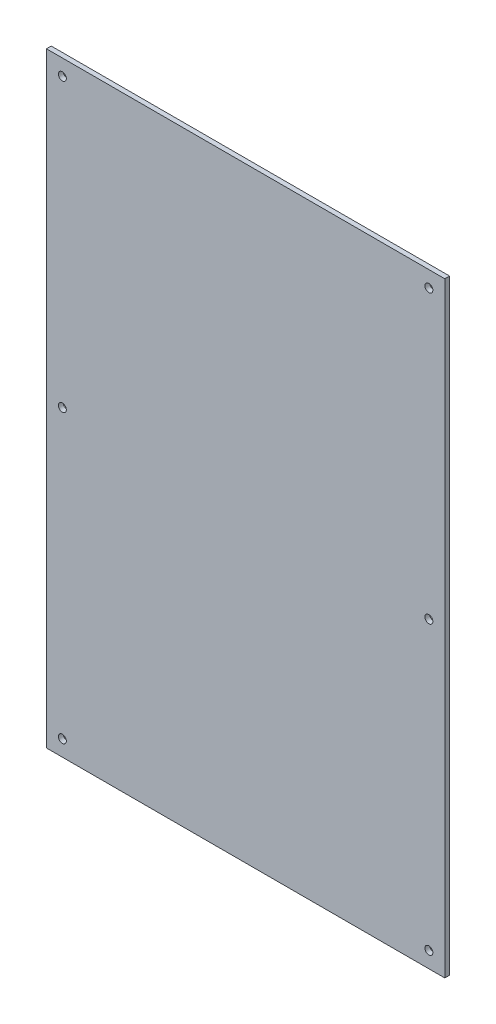
ISO-10303-21;
HEADER;
FILE_DESCRIPTION(('STEP AP214'),'2;1');
FILE_NAME('part.step','',(''),(''),'','','');
FILE_SCHEMA(('AUTOMOTIVE_DESIGN { 1 0 10303 214 1 1 1 1 }'));
ENDSEC;
DATA;
#1=APPLICATION_CONTEXT('core data for automotive mechanical design processes');
#2=APPLICATION_PROTOCOL_DEFINITION('international standard','automotive_design',2000,#1);
#3=PRODUCT_CONTEXT('',#1,'mechanical');
#4=PRODUCT('Part','Part','',(#3));
#5=PRODUCT_RELATED_PRODUCT_CATEGORY('part','',(#4));
#6=PRODUCT_DEFINITION_FORMATION('','',#4);
#7=PRODUCT_DEFINITION_CONTEXT('part definition',#1,'design');
#8=PRODUCT_DEFINITION('design','',#6,#7);
#9=PRODUCT_DEFINITION_SHAPE('','',#8);
#10=(LENGTH_UNIT() NAMED_UNIT(*) SI_UNIT(.MILLI.,.METRE.));
#11=(NAMED_UNIT(*) PLANE_ANGLE_UNIT() SI_UNIT($,.RADIAN.));
#12=(NAMED_UNIT(*) SI_UNIT($,.STERADIAN.) SOLID_ANGLE_UNIT());
#13=UNCERTAINTY_MEASURE_WITH_UNIT(LENGTH_MEASURE(1.E-05),#10,'distance_accuracy_value','');
#14=(GEOMETRIC_REPRESENTATION_CONTEXT(3) GLOBAL_UNCERTAINTY_ASSIGNED_CONTEXT((#13)) GLOBAL_UNIT_ASSIGNED_CONTEXT((#10,
#11,#12)) REPRESENTATION_CONTEXT('',''));
#15=CARTESIAN_POINT('',(0.,0.,0.));
#16=DIRECTION('',(0.,0.,1.));
#17=DIRECTION('',(1.,0.,0.));
#18=AXIS2_PLACEMENT_3D('',#15,#16,#17);
#19=CARTESIAN_POINT('',(214.837784558372,66.14717097171,3.));
#20=DIRECTION('',(0.,0.,-1.));
#21=DIRECTION('',(-1.,0.,0.));
#22=AXIS2_PLACEMENT_3D('',#19,#20,#21);
#23=PLANE('',#22);
#24=CARTESIAN_POINT('',(204.837784558372,-123.85282902829,3.));
#25=DIRECTION('',(0.,0.,1.));
#26=DIRECTION('',(1.,0.,0.));
#27=AXIS2_PLACEMENT_3D('',#24,#25,#26);
#28=CIRCLE('',#27,2.5);
#29=CARTESIAN_POINT('',(207.337784558372,-123.85282902829,3.));
#30=VERTEX_POINT('',#29);
#31=EDGE_CURVE('E129',#30,#30,#28,.T.);
#32=ORIENTED_EDGE('',*,*,#31,.F.);
#33=EDGE_LOOP('',(#32));
#34=FACE_BOUND('',#33,.T.);
#35=CARTESIAN_POINT('',(204.837784558372,-303.85282902829,3.));
#36=DIRECTION('',(0.,0.,1.));
#37=DIRECTION('',(1.,0.,0.));
#38=AXIS2_PLACEMENT_3D('',#35,#36,#37);
#39=CIRCLE('',#38,2.5);
#40=CARTESIAN_POINT('',(207.337784558372,-303.85282902829,3.));
#41=VERTEX_POINT('',#40);
#42=EDGE_CURVE('E139',#41,#41,#39,.T.);
#43=ORIENTED_EDGE('',*,*,#42,.F.);
#44=EDGE_LOOP('',(#43));
#45=FACE_BOUND('',#44,.T.);
#46=CARTESIAN_POINT('',(-25.1622154416282,56.14717097171,3.));
#47=DIRECTION('',(0.,0.,1.));
#48=DIRECTION('',(1.,0.,0.));
#49=AXIS2_PLACEMENT_3D('',#46,#47,#48);
#50=CIRCLE('',#49,2.5);
#51=CARTESIAN_POINT('',(-22.6622154416282,56.14717097171,3.));
#52=VERTEX_POINT('',#51);
#53=EDGE_CURVE('E97',#52,#52,#50,.T.);
#54=ORIENTED_EDGE('',*,*,#53,.F.);
#55=EDGE_LOOP('',(#54));
#56=FACE_BOUND('',#55,.T.);
#57=DIRECTION('',(-1.,0.,0.));
#58=VECTOR('',#57,1.);
#59=CARTESIAN_POINT('',(92.3377845583718,66.14717097171,3.));
#60=LINE('',#59,#58);
#61=CARTESIAN_POINT('',(214.837784558372,66.14717097171,3.));
#62=VERTEX_POINT('',#61);
#63=CARTESIAN_POINT('',(-35.1622154416282,66.14717097171,3.));
#64=VERTEX_POINT('',#63);
#65=EDGE_CURVE('E76',#62,#64,#60,.T.);
#66=ORIENTED_EDGE('',*,*,#65,.T.);
#67=DIRECTION('',(0.,-1.,0.));
#68=VECTOR('',#67,1.);
#69=CARTESIAN_POINT('',(-35.1622154416282,66.14717097171,3.));
#70=LINE('',#69,#68);
#71=CARTESIAN_POINT('',(-35.1622154416282,-313.85282902829,3.));
#72=VERTEX_POINT('',#71);
#73=EDGE_CURVE('E79',#64,#72,#70,.T.);
#74=ORIENTED_EDGE('',*,*,#73,.T.);
#75=DIRECTION('',(1.,0.,0.));
#76=VECTOR('',#75,1.);
#77=CARTESIAN_POINT('',(87.3377845583719,-313.85282902829,3.));
#78=LINE('',#77,#76);
#79=CARTESIAN_POINT('',(214.837784558372,-313.85282902829,3.));
#80=VERTEX_POINT('',#79);
#81=EDGE_CURVE('E83',#72,#80,#78,.T.);
#82=ORIENTED_EDGE('',*,*,#81,.T.);
#83=DIRECTION('',(0.,1.,0.));
#84=VECTOR('',#83,1.);
#85=CARTESIAN_POINT('',(214.837784558372,66.14717097171,3.));
#86=LINE('',#85,#84);
#87=EDGE_CURVE('E48',#80,#62,#86,.T.);
#88=ORIENTED_EDGE('',*,*,#87,.T.);
#89=EDGE_LOOP('',(#66,#74,#82,#88));
#90=FACE_BOUND('',#89,.T.);
#91=CARTESIAN_POINT('',(204.837784558372,56.14717097171,3.));
#92=DIRECTION('',(0.,0.,1.));
#93=DIRECTION('',(-1.,0.,0.));
#94=AXIS2_PLACEMENT_3D('',#91,#92,#93);
#95=CIRCLE('',#94,2.5);
#96=CARTESIAN_POINT('',(202.337784558372,56.14717097171,3.));
#97=VERTEX_POINT('',#96);
#98=EDGE_CURVE('E144',#97,#97,#95,.T.);
#99=ORIENTED_EDGE('',*,*,#98,.F.);
#100=EDGE_LOOP('',(#99));
#101=FACE_BOUND('',#100,.T.);
#102=CARTESIAN_POINT('',(-25.1622154416282,-303.85282902829,3.));
#103=DIRECTION('',(0.,0.,1.));
#104=DIRECTION('',(-1.,0.,0.));
#105=AXIS2_PLACEMENT_3D('',#102,#103,#104);
#106=CIRCLE('',#105,2.5);
#107=CARTESIAN_POINT('',(-27.6622154416282,-303.85282902829,3.));
#108=VERTEX_POINT('',#107);
#109=EDGE_CURVE('E134',#108,#108,#106,.T.);
#110=ORIENTED_EDGE('',*,*,#109,.F.);
#111=EDGE_LOOP('',(#110));
#112=FACE_BOUND('',#111,.T.);
#113=CARTESIAN_POINT('',(-25.1622154416281,-123.85282902829,3.));
#114=DIRECTION('',(0.,0.,1.));
#115=DIRECTION('',(-1.,0.,0.));
#116=AXIS2_PLACEMENT_3D('',#113,#114,#115);
#117=CIRCLE('',#116,2.5);
#118=CARTESIAN_POINT('',(-27.6622154416281,-123.85282902829,3.));
#119=VERTEX_POINT('',#118);
#120=EDGE_CURVE('E123',#119,#119,#117,.T.);
#121=ORIENTED_EDGE('',*,*,#120,.F.);
#122=EDGE_LOOP('',(#121));
#123=FACE_BOUND('',#122,.T.);
#124=ADVANCED_FACE('F31',(#34,#45,#56,#90,#101,#112,#123),#23,.F.);
#125=CARTESIAN_POINT('',(214.837784558372,66.14717097171,0.));
#126=DIRECTION('',(0.,0.,-1.));
#127=DIRECTION('',(-1.,0.,0.));
#128=AXIS2_PLACEMENT_3D('',#125,#126,#127);
#129=PLANE('',#128);
#130=CARTESIAN_POINT('',(204.837784558372,-123.85282902829,0.));
#131=DIRECTION('',(0.,0.,1.));
#132=DIRECTION('',(1.,0.,0.));
#133=AXIS2_PLACEMENT_3D('',#130,#131,#132);
#134=CIRCLE('',#133,2.5);
#135=CARTESIAN_POINT('',(207.337784558372,-123.85282902829,0.));
#136=VERTEX_POINT('',#135);
#137=EDGE_CURVE('E126',#136,#136,#134,.T.);
#138=ORIENTED_EDGE('',*,*,#137,.T.);
#139=EDGE_LOOP('',(#138));
#140=FACE_BOUND('',#139,.T.);
#141=CARTESIAN_POINT('',(204.837784558372,-303.85282902829,0.));
#142=DIRECTION('',(0.,0.,1.));
#143=DIRECTION('',(1.,0.,0.));
#144=AXIS2_PLACEMENT_3D('',#141,#142,#143);
#145=CIRCLE('',#144,2.5);
#146=CARTESIAN_POINT('',(207.337784558372,-303.85282902829,0.));
#147=VERTEX_POINT('',#146);
#148=EDGE_CURVE('E137',#147,#147,#145,.T.);
#149=ORIENTED_EDGE('',*,*,#148,.T.);
#150=EDGE_LOOP('',(#149));
#151=FACE_BOUND('',#150,.T.);
#152=CARTESIAN_POINT('',(-25.1622154416282,56.14717097171,0.));
#153=DIRECTION('',(0.,0.,1.));
#154=DIRECTION('',(1.,0.,0.));
#155=AXIS2_PLACEMENT_3D('',#152,#153,#154);
#156=CIRCLE('',#155,2.5);
#157=CARTESIAN_POINT('',(-22.6622154416282,56.14717097171,0.));
#158=VERTEX_POINT('',#157);
#159=EDGE_CURVE('E147',#158,#158,#156,.T.);
#160=ORIENTED_EDGE('',*,*,#159,.T.);
#161=EDGE_LOOP('',(#160));
#162=FACE_BOUND('',#161,.T.);
#163=DIRECTION('',(-1.,0.,0.));
#164=VECTOR('',#163,1.);
#165=CARTESIAN_POINT('',(87.3377845583718,66.14717097171,0.));
#166=LINE('',#165,#164);
#167=CARTESIAN_POINT('',(214.837784558372,66.14717097171,0.));
#168=VERTEX_POINT('',#167);
#169=CARTESIAN_POINT('',(-35.1622154416282,66.14717097171,0.));
#170=VERTEX_POINT('',#169);
#171=EDGE_CURVE('E71',#168,#170,#166,.T.);
#172=ORIENTED_EDGE('',*,*,#171,.F.);
#173=DIRECTION('',(0.,1.,0.));
#174=VECTOR('',#173,1.);
#175=CARTESIAN_POINT('',(214.837784558372,66.14717097171,0.));
#176=LINE('',#175,#174);
#177=CARTESIAN_POINT('',(214.837784558372,-313.85282902829,0.));
#178=VERTEX_POINT('',#177);
#179=EDGE_CURVE('E100',#178,#168,#176,.T.);
#180=ORIENTED_EDGE('',*,*,#179,.F.);
#181=DIRECTION('',(1.,0.,0.));
#182=VECTOR('',#181,1.);
#183=CARTESIAN_POINT('',(92.3377845583718,-313.85282902829,0.));
#184=LINE('',#183,#182);
#185=CARTESIAN_POINT('',(-35.1622154416282,-313.85282902829,0.));
#186=VERTEX_POINT('',#185);
#187=EDGE_CURVE('E64',#186,#178,#184,.T.);
#188=ORIENTED_EDGE('',*,*,#187,.F.);
#189=DIRECTION('',(0.,-1.,0.));
#190=VECTOR('',#189,1.);
#191=CARTESIAN_POINT('',(-35.1622154416282,66.14717097171,0.));
#192=LINE('',#191,#190);
#193=EDGE_CURVE('E88',#170,#186,#192,.T.);
#194=ORIENTED_EDGE('',*,*,#193,.F.);
#195=EDGE_LOOP('',(#172,#180,#188,#194));
#196=FACE_BOUND('',#195,.T.);
#197=CARTESIAN_POINT('',(204.837784558372,56.14717097171,0.));
#198=DIRECTION('',(0.,0.,1.));
#199=DIRECTION('',(-1.,0.,0.));
#200=AXIS2_PLACEMENT_3D('',#197,#198,#199);
#201=CIRCLE('',#200,2.5);
#202=CARTESIAN_POINT('',(202.337784558372,56.14717097171,0.));
#203=VERTEX_POINT('',#202);
#204=EDGE_CURVE('E114',#203,#203,#201,.T.);
#205=ORIENTED_EDGE('',*,*,#204,.T.);
#206=EDGE_LOOP('',(#205));
#207=FACE_BOUND('',#206,.T.);
#208=CARTESIAN_POINT('',(-25.1622154416282,-303.85282902829,0.));
#209=DIRECTION('',(0.,0.,1.));
#210=DIRECTION('',(-1.,0.,0.));
#211=AXIS2_PLACEMENT_3D('',#208,#209,#210);
#212=CIRCLE('',#211,2.5);
#213=CARTESIAN_POINT('',(-27.6622154416282,-303.85282902829,0.));
#214=VERTEX_POINT('',#213);
#215=EDGE_CURVE('E118',#214,#214,#212,.T.);
#216=ORIENTED_EDGE('',*,*,#215,.T.);
#217=EDGE_LOOP('',(#216));
#218=FACE_BOUND('',#217,.T.);
#219=CARTESIAN_POINT('',(-25.1622154416281,-123.85282902829,0.));
#220=DIRECTION('',(0.,0.,1.));
#221=DIRECTION('',(-1.,0.,0.));
#222=AXIS2_PLACEMENT_3D('',#219,#220,#221);
#223=CIRCLE('',#222,2.5);
#224=CARTESIAN_POINT('',(-27.6622154416281,-123.85282902829,0.));
#225=VERTEX_POINT('',#224);
#226=EDGE_CURVE('E121',#225,#225,#223,.T.);
#227=ORIENTED_EDGE('',*,*,#226,.T.);
#228=EDGE_LOOP('',(#227));
#229=FACE_BOUND('',#228,.T.);
#230=ADVANCED_FACE('F106',(#140,#151,#162,#196,#207,#218,#229),#129,.T.);
#231=CARTESIAN_POINT('',(87.3377845583718,66.14717097171,3.));
#232=DIRECTION('',(0.,-1.,0.));
#233=DIRECTION('',(0.,0.,-1.));
#234=AXIS2_PLACEMENT_3D('',#231,#232,#233);
#235=PLANE('',#234);
#236=ORIENTED_EDGE('',*,*,#171,.T.);
#237=DIRECTION('',(0.,0.,-1.));
#238=VECTOR('',#237,1.);
#239=CARTESIAN_POINT('',(-35.1622154416282,66.14717097171,3.));
#240=LINE('',#239,#238);
#241=EDGE_CURVE('E11',#64,#170,#240,.T.);
#242=ORIENTED_EDGE('',*,*,#241,.F.);
#243=ORIENTED_EDGE('',*,*,#65,.F.);
#244=DIRECTION('',(0.,0.,-1.));
#245=VECTOR('',#244,1.);
#246=CARTESIAN_POINT('',(214.837784558372,66.14717097171,3.));
#247=LINE('',#246,#245);
#248=EDGE_CURVE('E92',#62,#168,#247,.T.);
#249=ORIENTED_EDGE('',*,*,#248,.T.);
#250=EDGE_LOOP('',(#236,#242,#243,#249));
#251=FACE_BOUND('',#250,.T.);
#252=ADVANCED_FACE('F33',(#251),#235,.F.);
#253=CARTESIAN_POINT('',(-35.1622154416282,66.14717097171,3.));
#254=DIRECTION('',(1.,0.,0.));
#255=DIRECTION('',(0.,0.,-1.));
#256=AXIS2_PLACEMENT_3D('',#253,#254,#255);
#257=PLANE('',#256);
#258=ORIENTED_EDGE('',*,*,#193,.T.);
#259=DIRECTION('',(0.,0.,-1.));
#260=VECTOR('',#259,1.);
#261=CARTESIAN_POINT('',(-35.1622154416282,-313.85282902829,3.));
#262=LINE('',#261,#260);
#263=EDGE_CURVE('E40',#72,#186,#262,.T.);
#264=ORIENTED_EDGE('',*,*,#263,.F.);
#265=ORIENTED_EDGE('',*,*,#73,.F.);
#266=ORIENTED_EDGE('',*,*,#241,.T.);
#267=EDGE_LOOP('',(#258,#264,#265,#266));
#268=FACE_BOUND('',#267,.T.);
#269=ADVANCED_FACE('F87',(#268),#257,.F.);
#270=CARTESIAN_POINT('',(92.3377845583718,-313.85282902829,3.));
#271=DIRECTION('',(0.,1.,0.));
#272=DIRECTION('',(0.,0.,1.));
#273=AXIS2_PLACEMENT_3D('',#270,#271,#272);
#274=PLANE('',#273);
#275=ORIENTED_EDGE('',*,*,#187,.T.);
#276=DIRECTION('',(0.,0.,-1.));
#277=VECTOR('',#276,1.);
#278=CARTESIAN_POINT('',(214.837784558372,-313.85282902829,3.));
#279=LINE('',#278,#277);
#280=EDGE_CURVE('E89',#80,#178,#279,.T.);
#281=ORIENTED_EDGE('',*,*,#280,.F.);
#282=ORIENTED_EDGE('',*,*,#81,.F.);
#283=ORIENTED_EDGE('',*,*,#263,.T.);
#284=EDGE_LOOP('',(#275,#281,#282,#283));
#285=FACE_BOUND('',#284,.T.);
#286=ADVANCED_FACE('F90',(#285),#274,.F.);
#287=CARTESIAN_POINT('',(214.837784558372,66.14717097171,3.));
#288=DIRECTION('',(-1.,0.,0.));
#289=DIRECTION('',(0.,0.,1.));
#290=AXIS2_PLACEMENT_3D('',#287,#288,#289);
#291=PLANE('',#290);
#292=ORIENTED_EDGE('',*,*,#179,.T.);
#293=ORIENTED_EDGE('',*,*,#248,.F.);
#294=ORIENTED_EDGE('',*,*,#87,.F.);
#295=ORIENTED_EDGE('',*,*,#280,.T.);
#296=EDGE_LOOP('',(#292,#293,#294,#295));
#297=FACE_BOUND('',#296,.T.);
#298=ADVANCED_FACE('F105',(#297),#291,.F.);
#299=CARTESIAN_POINT('',(-25.1622154416282,56.14717097171,3.));
#300=DIRECTION('',(0.,0.,-1.));
#301=DIRECTION('',(-1.,0.,0.));
#302=AXIS2_PLACEMENT_3D('',#299,#300,#301);
#303=CYLINDRICAL_SURFACE('',#302,2.5);
#304=ORIENTED_EDGE('',*,*,#53,.T.);
#305=EDGE_LOOP('',(#304));
#306=FACE_BOUND('',#305,.T.);
#307=ORIENTED_EDGE('',*,*,#159,.F.);
#308=EDGE_LOOP('',(#307));
#309=FACE_BOUND('',#308,.T.);
#310=ADVANCED_FACE('F155',(#306,#309),#303,.F.);
#311=CARTESIAN_POINT('',(204.837784558372,56.14717097171,3.));
#312=DIRECTION('',(0.,0.,-1.));
#313=DIRECTION('',(-1.,0.,0.));
#314=AXIS2_PLACEMENT_3D('',#311,#312,#313);
#315=CYLINDRICAL_SURFACE('',#314,2.5);
#316=ORIENTED_EDGE('',*,*,#98,.T.);
#317=EDGE_LOOP('',(#316));
#318=FACE_BOUND('',#317,.T.);
#319=ORIENTED_EDGE('',*,*,#204,.F.);
#320=EDGE_LOOP('',(#319));
#321=FACE_BOUND('',#320,.T.);
#322=ADVANCED_FACE('F157',(#318,#321),#315,.F.);
#323=CARTESIAN_POINT('',(204.837784558372,-303.85282902829,3.));
#324=DIRECTION('',(0.,0.,-1.));
#325=DIRECTION('',(-1.,0.,0.));
#326=AXIS2_PLACEMENT_3D('',#323,#324,#325);
#327=CYLINDRICAL_SURFACE('',#326,2.5);
#328=ORIENTED_EDGE('',*,*,#42,.T.);
#329=EDGE_LOOP('',(#328));
#330=FACE_BOUND('',#329,.T.);
#331=ORIENTED_EDGE('',*,*,#148,.F.);
#332=EDGE_LOOP('',(#331));
#333=FACE_BOUND('',#332,.T.);
#334=ADVANCED_FACE('F164',(#330,#333),#327,.F.);
#335=CARTESIAN_POINT('',(-25.1622154416282,-303.85282902829,3.));
#336=DIRECTION('',(0.,0.,-1.));
#337=DIRECTION('',(-1.,0.,0.));
#338=AXIS2_PLACEMENT_3D('',#335,#336,#337);
#339=CYLINDRICAL_SURFACE('',#338,2.5);
#340=ORIENTED_EDGE('',*,*,#109,.T.);
#341=EDGE_LOOP('',(#340));
#342=FACE_BOUND('',#341,.T.);
#343=ORIENTED_EDGE('',*,*,#215,.F.);
#344=EDGE_LOOP('',(#343));
#345=FACE_BOUND('',#344,.T.);
#346=ADVANCED_FACE('F239',(#342,#345),#339,.F.);
#347=CARTESIAN_POINT('',(204.837784558372,-123.85282902829,3.));
#348=DIRECTION('',(0.,0.,-1.));
#349=DIRECTION('',(-1.,0.,0.));
#350=AXIS2_PLACEMENT_3D('',#347,#348,#349);
#351=CYLINDRICAL_SURFACE('',#350,2.5);
#352=ORIENTED_EDGE('',*,*,#31,.T.);
#353=EDGE_LOOP('',(#352));
#354=FACE_BOUND('',#353,.T.);
#355=ORIENTED_EDGE('',*,*,#137,.F.);
#356=EDGE_LOOP('',(#355));
#357=FACE_BOUND('',#356,.T.);
#358=ADVANCED_FACE('F248',(#354,#357),#351,.F.);
#359=CARTESIAN_POINT('',(-25.1622154416281,-123.85282902829,3.));
#360=DIRECTION('',(0.,0.,-1.));
#361=DIRECTION('',(-1.,0.,0.));
#362=AXIS2_PLACEMENT_3D('',#359,#360,#361);
#363=CYLINDRICAL_SURFACE('',#362,2.5);
#364=ORIENTED_EDGE('',*,*,#120,.T.);
#365=EDGE_LOOP('',(#364));
#366=FACE_BOUND('',#365,.T.);
#367=ORIENTED_EDGE('',*,*,#226,.F.);
#368=EDGE_LOOP('',(#367));
#369=FACE_BOUND('',#368,.T.);
#370=ADVANCED_FACE('F257',(#366,#369),#363,.F.);
#371=CLOSED_SHELL('',(#124,#230,#252,#269,#286,#298,#310,#322,#334,#346,#358,#370));
#372=MANIFOLD_SOLID_BREP('B2',#371);
#373=ADVANCED_BREP_SHAPE_REPRESENTATION('',(#18,#372),#14);
#374=SHAPE_DEFINITION_REPRESENTATION(#9,#373);
ENDSEC;
END-ISO-10303-21;
